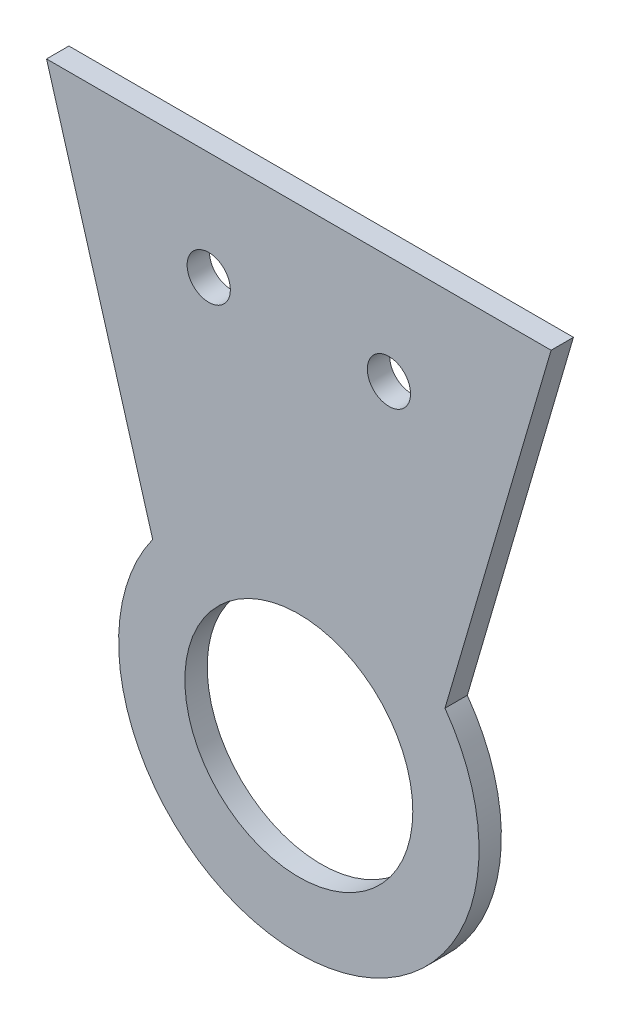
ISO-10303-21;
HEADER;
FILE_DESCRIPTION(('STEP AP214'),'2;1');
FILE_NAME('part.step','',(''),(''),'','','');
FILE_SCHEMA(('AUTOMOTIVE_DESIGN { 1 0 10303 214 1 1 1 1 }'));
ENDSEC;
DATA;
#1=APPLICATION_CONTEXT('core data for automotive mechanical design processes');
#2=APPLICATION_PROTOCOL_DEFINITION('international standard','automotive_design',2000,#1);
#3=PRODUCT_CONTEXT('',#1,'mechanical');
#4=PRODUCT('Part','Part','',(#3));
#5=PRODUCT_RELATED_PRODUCT_CATEGORY('part','',(#4));
#6=PRODUCT_DEFINITION_FORMATION('','',#4);
#7=PRODUCT_DEFINITION_CONTEXT('part definition',#1,'design');
#8=PRODUCT_DEFINITION('design','',#6,#7);
#9=PRODUCT_DEFINITION_SHAPE('','',#8);
#10=(LENGTH_UNIT() NAMED_UNIT(*) SI_UNIT(.MILLI.,.METRE.));
#11=(NAMED_UNIT(*) PLANE_ANGLE_UNIT() SI_UNIT($,.RADIAN.));
#12=(NAMED_UNIT(*) SI_UNIT($,.STERADIAN.) SOLID_ANGLE_UNIT());
#13=UNCERTAINTY_MEASURE_WITH_UNIT(LENGTH_MEASURE(1.E-05),#10,'distance_accuracy_value','');
#14=(GEOMETRIC_REPRESENTATION_CONTEXT(3) GLOBAL_UNCERTAINTY_ASSIGNED_CONTEXT((#13)) GLOBAL_UNIT_ASSIGNED_CONTEXT((#10,
#11,#12)) REPRESENTATION_CONTEXT('',''));
#15=CARTESIAN_POINT('',(0.,0.,0.));
#16=DIRECTION('',(0.,0.,1.));
#17=DIRECTION('',(1.,0.,0.));
#18=AXIS2_PLACEMENT_3D('',#15,#16,#17);
#19=CARTESIAN_POINT('',(0.,0.,3.1));
#20=DIRECTION('',(0.,0.,-1.));
#21=DIRECTION('',(-1.,0.,0.));
#22=AXIS2_PLACEMENT_3D('',#19,#20,#21);
#23=PLANE('',#22);
#24=CARTESIAN_POINT('',(-12.5,50.,3.1));
#25=DIRECTION('',(0.,0.,1.));
#26=DIRECTION('',(1.,0.,0.));
#27=AXIS2_PLACEMENT_3D('',#24,#25,#26);
#28=CIRCLE('',#27,3.);
#29=CARTESIAN_POINT('',(-9.5,50.,3.1));
#30=VERTEX_POINT('',#29);
#31=EDGE_CURVE('E96',#30,#30,#28,.T.);
#32=ORIENTED_EDGE('',*,*,#31,.F.);
#33=EDGE_LOOP('',(#32));
#34=FACE_BOUND('',#33,.T.);
#35=DIRECTION('',(-1.,0.,0.));
#36=VECTOR('',#35,1.);
#37=CARTESIAN_POINT('',(-35.,65.,3.1));
#38=LINE('',#37,#36);
#39=CARTESIAN_POINT('',(35.,64.9999999999999,3.09999999999999));
#40=VERTEX_POINT('',#39);
#41=CARTESIAN_POINT('',(-35.,65.,3.09999999999999));
#42=VERTEX_POINT('',#41);
#43=EDGE_CURVE('E78',#40,#42,#38,.T.);
#44=ORIENTED_EDGE('',*,*,#43,.T.);
#45=DIRECTION('',(0.280566991812824,-0.959834445675452,0.));
#46=VECTOR('',#45,1.);
#47=CARTESIAN_POINT('',(-14.7405146096816,-4.30876580898386,3.1));
#48=LINE('',#47,#46);
#49=CARTESIAN_POINT('',(-20.2752400105161,14.6258210886078,3.09999999999999));
#50=VERTEX_POINT('',#49);
#51=EDGE_CURVE('E111',#42,#50,#48,.T.);
#52=ORIENTED_EDGE('',*,*,#51,.T.);
#53=CARTESIAN_POINT('',(0.,0.,3.09999999999999));
#54=DIRECTION('',(0.,0.,-1.));
#55=DIRECTION('',(-1.,0.,0.));
#56=AXIS2_PLACEMENT_3D('',#53,#54,#55);
#57=CIRCLE('',#56,25.);
#58=CARTESIAN_POINT('',(20.2752400105161,14.6258210886078,3.09999999999999));
#59=VERTEX_POINT('',#58);
#60=EDGE_CURVE('E85',#50,#59,#57,.F.);
#61=ORIENTED_EDGE('',*,*,#60,.T.);
#62=DIRECTION('',(0.280566991812825,0.959834445675452,0.));
#63=VECTOR('',#62,1.);
#64=CARTESIAN_POINT('',(14.7405146096816,-4.30876580898387,3.1));
#65=LINE('',#64,#63);
#66=EDGE_CURVE('E72',#59,#40,#65,.T.);
#67=ORIENTED_EDGE('',*,*,#66,.T.);
#68=EDGE_LOOP('',(#44,#52,#61,#67));
#69=FACE_BOUND('',#68,.T.);
#70=CARTESIAN_POINT('',(0.,0.,3.1));
#71=DIRECTION('',(0.,0.,1.));
#72=DIRECTION('',(1.,0.,0.));
#73=AXIS2_PLACEMENT_3D('',#70,#71,#72);
#74=CIRCLE('',#73,15.8115);
#75=CARTESIAN_POINT('',(15.8115,0.,3.1));
#76=VERTEX_POINT('',#75);
#77=EDGE_CURVE('E90',#76,#76,#74,.T.);
#78=ORIENTED_EDGE('',*,*,#77,.F.);
#79=EDGE_LOOP('',(#78));
#80=FACE_BOUND('',#79,.T.);
#81=CARTESIAN_POINT('',(12.5,50.,3.1));
#82=DIRECTION('',(0.,0.,1.));
#83=DIRECTION('',(-1.,0.,0.));
#84=AXIS2_PLACEMENT_3D('',#81,#82,#83);
#85=CIRCLE('',#84,3.00000000000001);
#86=CARTESIAN_POINT('',(9.49999999999999,50.,3.1));
#87=VERTEX_POINT('',#86);
#88=EDGE_CURVE('E102',#87,#87,#85,.T.);
#89=ORIENTED_EDGE('',*,*,#88,.F.);
#90=EDGE_LOOP('',(#89));
#91=FACE_BOUND('',#90,.T.);
#92=ADVANCED_FACE('F32',(#34,#69,#80,#91),#23,.F.);
#93=CARTESIAN_POINT('',(0.,0.,0.));
#94=DIRECTION('',(0.,0.,-1.));
#95=DIRECTION('',(-1.,0.,0.));
#96=AXIS2_PLACEMENT_3D('',#93,#94,#95);
#97=PLANE('',#96);
#98=DIRECTION('',(0.280566991812824,-0.959834445675452,0.));
#99=VECTOR('',#98,1.);
#100=CARTESIAN_POINT('',(-14.7405146096816,-4.30876580898386,0.));
#101=LINE('',#100,#99);
#102=CARTESIAN_POINT('',(-35.,65.,0.));
#103=VERTEX_POINT('',#102);
#104=CARTESIAN_POINT('',(-20.2752400105161,14.6258210886078,0.));
#105=VERTEX_POINT('',#104);
#106=EDGE_CURVE('E86',#103,#105,#101,.T.);
#107=ORIENTED_EDGE('',*,*,#106,.F.);
#108=DIRECTION('',(-1.,0.,0.));
#109=VECTOR('',#108,1.);
#110=CARTESIAN_POINT('',(-35.,65.,0.));
#111=LINE('',#110,#109);
#112=CARTESIAN_POINT('',(35.,65.,0.));
#113=VERTEX_POINT('',#112);
#114=EDGE_CURVE('E88',#113,#103,#111,.T.);
#115=ORIENTED_EDGE('',*,*,#114,.F.);
#116=DIRECTION('',(0.280566991812825,0.959834445675452,0.));
#117=VECTOR('',#116,1.);
#118=CARTESIAN_POINT('',(14.7405146096816,-4.30876580898387,0.));
#119=LINE('',#118,#117);
#120=CARTESIAN_POINT('',(20.2752400105161,14.6258210886078,0.));
#121=VERTEX_POINT('',#120);
#122=EDGE_CURVE('E47',#121,#113,#119,.T.);
#123=ORIENTED_EDGE('',*,*,#122,.F.);
#124=CARTESIAN_POINT('',(0.,0.,0.));
#125=DIRECTION('',(0.,0.,-1.));
#126=DIRECTION('',(-1.,0.,0.));
#127=AXIS2_PLACEMENT_3D('',#124,#125,#126);
#128=CIRCLE('',#127,25.);
#129=EDGE_CURVE('E11',#105,#121,#128,.F.);
#130=ORIENTED_EDGE('',*,*,#129,.F.);
#131=EDGE_LOOP('',(#107,#115,#123,#130));
#132=FACE_BOUND('',#131,.T.);
#133=CARTESIAN_POINT('',(-12.5,50.,0.));
#134=DIRECTION('',(0.,0.,1.));
#135=DIRECTION('',(1.,0.,0.));
#136=AXIS2_PLACEMENT_3D('',#133,#134,#135);
#137=CIRCLE('',#136,3.);
#138=CARTESIAN_POINT('',(-9.5,50.,0.));
#139=VERTEX_POINT('',#138);
#140=EDGE_CURVE('E99',#139,#139,#137,.T.);
#141=ORIENTED_EDGE('',*,*,#140,.T.);
#142=EDGE_LOOP('',(#141));
#143=FACE_BOUND('',#142,.T.);
#144=CARTESIAN_POINT('',(0.,0.,0.));
#145=DIRECTION('',(0.,0.,1.));
#146=DIRECTION('',(1.,0.,0.));
#147=AXIS2_PLACEMENT_3D('',#144,#145,#146);
#148=CIRCLE('',#147,15.8115);
#149=CARTESIAN_POINT('',(15.8115,0.,0.));
#150=VERTEX_POINT('',#149);
#151=EDGE_CURVE('E93',#150,#150,#148,.T.);
#152=ORIENTED_EDGE('',*,*,#151,.T.);
#153=EDGE_LOOP('',(#152));
#154=FACE_BOUND('',#153,.T.);
#155=CARTESIAN_POINT('',(12.5,50.,0.));
#156=DIRECTION('',(0.,0.,1.));
#157=DIRECTION('',(-1.,0.,0.));
#158=AXIS2_PLACEMENT_3D('',#155,#156,#157);
#159=CIRCLE('',#158,3.00000000000001);
#160=CARTESIAN_POINT('',(9.49999999999999,50.,0.));
#161=VERTEX_POINT('',#160);
#162=EDGE_CURVE('E105',#161,#161,#159,.T.);
#163=ORIENTED_EDGE('',*,*,#162,.T.);
#164=EDGE_LOOP('',(#163));
#165=FACE_BOUND('',#164,.T.);
#166=ADVANCED_FACE('F122',(#132,#143,#154,#165),#97,.T.);
#167=CARTESIAN_POINT('',(-35.,65.,3.1));
#168=DIRECTION('',(0.,-1.,0.));
#169=DIRECTION('',(1.,0.,0.));
#170=AXIS2_PLACEMENT_3D('',#167,#168,#169);
#171=PLANE('',#170);
#172=ORIENTED_EDGE('',*,*,#114,.T.);
#173=DIRECTION('',(0.,0.,-1.));
#174=VECTOR('',#173,1.);
#175=CARTESIAN_POINT('',(-35.,65.,3.1));
#176=LINE('',#175,#174);
#177=EDGE_CURVE('E40',#42,#103,#176,.T.);
#178=ORIENTED_EDGE('',*,*,#177,.F.);
#179=ORIENTED_EDGE('',*,*,#43,.F.);
#180=DIRECTION('',(0.,0.,-1.));
#181=VECTOR('',#180,1.);
#182=CARTESIAN_POINT('',(35.,65.,3.1));
#183=LINE('',#182,#181);
#184=EDGE_CURVE('E69',#40,#113,#183,.T.);
#185=ORIENTED_EDGE('',*,*,#184,.T.);
#186=EDGE_LOOP('',(#172,#178,#179,#185));
#187=FACE_BOUND('',#186,.T.);
#188=ADVANCED_FACE('F34',(#187),#171,.F.);
#189=CARTESIAN_POINT('',(0.,0.,3.1));
#190=DIRECTION('',(0.,0.,-1.));
#191=DIRECTION('',(-1.,0.,0.));
#192=AXIS2_PLACEMENT_3D('',#189,#190,#191);
#193=CYLINDRICAL_SURFACE('',#192,15.8115);
#194=ORIENTED_EDGE('',*,*,#77,.T.);
#195=EDGE_LOOP('',(#194));
#196=FACE_BOUND('',#195,.T.);
#197=ORIENTED_EDGE('',*,*,#151,.F.);
#198=EDGE_LOOP('',(#197));
#199=FACE_BOUND('',#198,.T.);
#200=ADVANCED_FACE('F147',(#196,#199),#193,.F.);
#201=CARTESIAN_POINT('',(-12.5,50.,3.1));
#202=DIRECTION('',(0.,0.,-1.));
#203=DIRECTION('',(-1.,0.,0.));
#204=AXIS2_PLACEMENT_3D('',#201,#202,#203);
#205=CYLINDRICAL_SURFACE('',#204,3.);
#206=ORIENTED_EDGE('',*,*,#31,.T.);
#207=EDGE_LOOP('',(#206));
#208=FACE_BOUND('',#207,.T.);
#209=ORIENTED_EDGE('',*,*,#140,.F.);
#210=EDGE_LOOP('',(#209));
#211=FACE_BOUND('',#210,.T.);
#212=ADVANCED_FACE('F135',(#208,#211),#205,.F.);
#213=CARTESIAN_POINT('',(12.5,50.,3.1));
#214=DIRECTION('',(0.,0.,-1.));
#215=DIRECTION('',(-1.,0.,0.));
#216=AXIS2_PLACEMENT_3D('',#213,#214,#215);
#217=CYLINDRICAL_SURFACE('',#216,3.00000000000001);
#218=ORIENTED_EDGE('',*,*,#88,.T.);
#219=EDGE_LOOP('',(#218));
#220=FACE_BOUND('',#219,.T.);
#221=ORIENTED_EDGE('',*,*,#162,.F.);
#222=EDGE_LOOP('',(#221));
#223=FACE_BOUND('',#222,.T.);
#224=ADVANCED_FACE('F128',(#220,#223),#217,.F.);
#225=CARTESIAN_POINT('',(0.,0.,155.731142382543));
#226=DIRECTION('',(0.,0.,-1.));
#227=DIRECTION('',(-1.,0.,0.));
#228=AXIS2_PLACEMENT_3D('',#225,#226,#227);
#229=CYLINDRICAL_SURFACE('',#228,25.);
#230=ORIENTED_EDGE('',*,*,#60,.F.);
#231=DIRECTION('',(0.,0.,-1.));
#232=VECTOR('',#231,1.);
#233=CARTESIAN_POINT('',(-20.2752400105161,14.6258210886078,155.731142382543));
#234=LINE('',#233,#232);
#235=EDGE_CURVE('E115',#50,#105,#234,.T.);
#236=ORIENTED_EDGE('',*,*,#235,.T.);
#237=ORIENTED_EDGE('',*,*,#129,.T.);
#238=DIRECTION('',(0.,0.,-1.));
#239=VECTOR('',#238,1.);
#240=CARTESIAN_POINT('',(20.2752400105161,14.6258210886078,155.731142382543));
#241=LINE('',#240,#239);
#242=EDGE_CURVE('E118',#59,#121,#241,.T.);
#243=ORIENTED_EDGE('',*,*,#242,.F.);
#244=EDGE_LOOP('',(#230,#236,#237,#243));
#245=FACE_BOUND('',#244,.T.);
#246=ADVANCED_FACE('F126',(#245),#229,.T.);
#247=CARTESIAN_POINT('',(-35.,65.,155.731142382543));
#248=DIRECTION('',(0.959834445675452,0.280566991812824,0.));
#249=DIRECTION('',(-0.280566991812824,0.959834445675452,0.));
#250=AXIS2_PLACEMENT_3D('',#247,#248,#249);
#251=PLANE('',#250);
#252=ORIENTED_EDGE('',*,*,#51,.F.);
#253=ORIENTED_EDGE('',*,*,#177,.T.);
#254=ORIENTED_EDGE('',*,*,#106,.T.);
#255=ORIENTED_EDGE('',*,*,#235,.F.);
#256=EDGE_LOOP('',(#252,#253,#254,#255));
#257=FACE_BOUND('',#256,.T.);
#258=ADVANCED_FACE('F125',(#257),#251,.F.);
#259=CARTESIAN_POINT('',(20.2752400105161,14.6258210886078,155.731142382543));
#260=DIRECTION('',(-0.959834445675452,0.280566991812825,0.));
#261=DIRECTION('',(-0.280566991812825,-0.959834445675452,0.));
#262=AXIS2_PLACEMENT_3D('',#259,#260,#261);
#263=PLANE('',#262);
#264=ORIENTED_EDGE('',*,*,#66,.F.);
#265=ORIENTED_EDGE('',*,*,#242,.T.);
#266=ORIENTED_EDGE('',*,*,#122,.T.);
#267=ORIENTED_EDGE('',*,*,#184,.F.);
#268=EDGE_LOOP('',(#264,#265,#266,#267));
#269=FACE_BOUND('',#268,.T.);
#270=ADVANCED_FACE('F71',(#269),#263,.F.);
#271=CLOSED_SHELL('',(#92,#166,#188,#200,#212,#224,#246,#258,#270));
#272=MANIFOLD_SOLID_BREP('B2',#271);
#273=ADVANCED_BREP_SHAPE_REPRESENTATION('',(#18,#272),#14);
#274=SHAPE_DEFINITION_REPRESENTATION(#9,#273);
ENDSEC;
END-ISO-10303-21;
